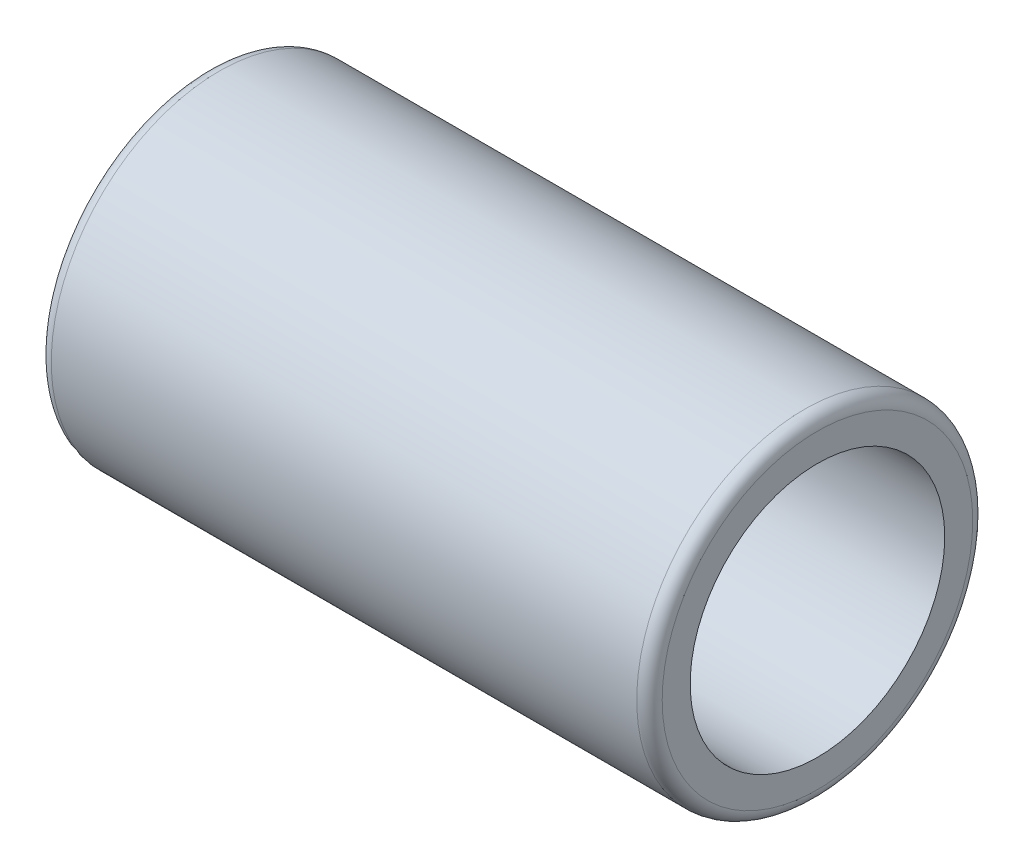
ISO-10303-21;
HEADER;
FILE_DESCRIPTION(('STEP AP214'),'2;1');
FILE_NAME('part.step','',(''),(''),'','','');
FILE_SCHEMA(('AUTOMOTIVE_DESIGN { 1 0 10303 214 1 1 1 1 }'));
ENDSEC;
DATA;
#1=APPLICATION_CONTEXT('core data for automotive mechanical design processes');
#2=APPLICATION_PROTOCOL_DEFINITION('international standard','automotive_design',2000,#1);
#3=PRODUCT_CONTEXT('',#1,'mechanical');
#4=PRODUCT('Part','Part','',(#3));
#5=PRODUCT_RELATED_PRODUCT_CATEGORY('part','',(#4));
#6=PRODUCT_DEFINITION_FORMATION('','',#4);
#7=PRODUCT_DEFINITION_CONTEXT('part definition',#1,'design');
#8=PRODUCT_DEFINITION('design','',#6,#7);
#9=PRODUCT_DEFINITION_SHAPE('','',#8);
#10=(LENGTH_UNIT() NAMED_UNIT(*) SI_UNIT(.MILLI.,.METRE.));
#11=(NAMED_UNIT(*) PLANE_ANGLE_UNIT() SI_UNIT($,.RADIAN.));
#12=(NAMED_UNIT(*) SI_UNIT($,.STERADIAN.) SOLID_ANGLE_UNIT());
#13=UNCERTAINTY_MEASURE_WITH_UNIT(LENGTH_MEASURE(1.E-05),#10,'distance_accuracy_value','');
#14=(GEOMETRIC_REPRESENTATION_CONTEXT(3) GLOBAL_UNCERTAINTY_ASSIGNED_CONTEXT((#13)) GLOBAL_UNIT_ASSIGNED_CONTEXT((#10,
#11,#12)) REPRESENTATION_CONTEXT('',''));
#15=CARTESIAN_POINT('',(0.,0.,0.));
#16=DIRECTION('',(0.,0.,1.));
#17=DIRECTION('',(1.,0.,0.));
#18=AXIS2_PLACEMENT_3D('',#15,#16,#17);
#19=CARTESIAN_POINT('',(-12.,0.,0.));
#20=DIRECTION('',(1.,0.,0.));
#21=DIRECTION('',(0.,0.,-1.));
#22=AXIS2_PLACEMENT_3D('',#19,#20,#21);
#23=CYLINDRICAL_SURFACE('',#22,6.6);
#24=CARTESIAN_POINT('',(11.5,0.,0.));
#25=DIRECTION('',(1.,0.,0.));
#26=DIRECTION('',(0.,0.,-1.));
#27=AXIS2_PLACEMENT_3D('',#24,#25,#26);
#28=CIRCLE('',#27,6.6);
#29=CARTESIAN_POINT('',(11.5,0.,-6.6));
#30=VERTEX_POINT('',#29);
#31=EDGE_CURVE('E42',#30,#30,#28,.F.);
#32=ORIENTED_EDGE('',*,*,#31,.T.);
#33=EDGE_LOOP('',(#32));
#34=FACE_BOUND('',#33,.T.);
#35=CARTESIAN_POINT('',(-11.5,0.,0.));
#36=DIRECTION('',(1.,0.,0.));
#37=DIRECTION('',(0.,0.,-1.));
#38=AXIS2_PLACEMENT_3D('',#35,#36,#37);
#39=CIRCLE('',#38,6.6);
#40=CARTESIAN_POINT('',(-11.5,0.,-6.6));
#41=VERTEX_POINT('',#40);
#42=EDGE_CURVE('E46',#41,#41,#39,.T.);
#43=ORIENTED_EDGE('',*,*,#42,.T.);
#44=EDGE_LOOP('',(#43));
#45=FACE_BOUND('',#44,.T.);
#46=ADVANCED_FACE('F35',(#34,#45),#23,.T.);
#47=CARTESIAN_POINT('',(-12.,0.,0.));
#48=DIRECTION('',(1.,0.,0.));
#49=DIRECTION('',(0.,0.,-1.));
#50=AXIS2_PLACEMENT_3D('',#47,#48,#49);
#51=PLANE('',#50);
#52=CARTESIAN_POINT('',(-12.,0.,0.));
#53=DIRECTION('',(1.,0.,0.));
#54=DIRECTION('',(0.,0.,-1.));
#55=AXIS2_PLACEMENT_3D('',#52,#53,#54);
#56=CIRCLE('',#55,6.1);
#57=CARTESIAN_POINT('',(-12.,0.,-6.1));
#58=VERTEX_POINT('',#57);
#59=EDGE_CURVE('E10',#58,#58,#56,.F.);
#60=ORIENTED_EDGE('',*,*,#59,.T.);
#61=EDGE_LOOP('',(#60));
#62=FACE_BOUND('',#61,.T.);
#63=CARTESIAN_POINT('',(-12.,0.,0.));
#64=DIRECTION('',(1.,0.,0.));
#65=DIRECTION('',(0.,0.,-1.));
#66=AXIS2_PLACEMENT_3D('',#63,#64,#65);
#67=CIRCLE('',#66,5.);
#68=CARTESIAN_POINT('',(-12.,0.,-5.));
#69=VERTEX_POINT('',#68);
#70=EDGE_CURVE('E55',#69,#69,#67,.T.);
#71=ORIENTED_EDGE('',*,*,#70,.T.);
#72=EDGE_LOOP('',(#71));
#73=FACE_BOUND('',#72,.T.);
#74=ADVANCED_FACE('F74',(#62,#73),#51,.F.);
#75=CARTESIAN_POINT('',(-12.,0.,0.));
#76=DIRECTION('',(1.,0.,0.));
#77=DIRECTION('',(0.,0.,-1.));
#78=AXIS2_PLACEMENT_3D('',#75,#76,#77);
#79=CYLINDRICAL_SURFACE('',#78,5.);
#80=ORIENTED_EDGE('',*,*,#70,.F.);
#81=EDGE_LOOP('',(#80));
#82=FACE_BOUND('',#81,.T.);
#83=CARTESIAN_POINT('',(12.,0.,0.));
#84=DIRECTION('',(1.,0.,0.));
#85=DIRECTION('',(0.,0.,-1.));
#86=AXIS2_PLACEMENT_3D('',#83,#84,#85);
#87=CIRCLE('',#86,5.);
#88=CARTESIAN_POINT('',(12.,0.,-5.));
#89=VERTEX_POINT('',#88);
#90=EDGE_CURVE('E58',#89,#89,#87,.T.);
#91=ORIENTED_EDGE('',*,*,#90,.T.);
#92=EDGE_LOOP('',(#91));
#93=FACE_BOUND('',#92,.T.);
#94=ADVANCED_FACE('F62',(#82,#93),#79,.F.);
#95=CARTESIAN_POINT('',(12.,0.,0.));
#96=DIRECTION('',(1.,0.,0.));
#97=DIRECTION('',(0.,0.,-1.));
#98=AXIS2_PLACEMENT_3D('',#95,#96,#97);
#99=PLANE('',#98);
#100=CARTESIAN_POINT('',(12.,0.,0.));
#101=DIRECTION('',(1.,0.,0.));
#102=DIRECTION('',(0.,0.,-1.));
#103=AXIS2_PLACEMENT_3D('',#100,#101,#102);
#104=CIRCLE('',#103,6.1);
#105=CARTESIAN_POINT('',(12.,0.,-6.1));
#106=VERTEX_POINT('',#105);
#107=EDGE_CURVE('E50',#106,#106,#104,.T.);
#108=ORIENTED_EDGE('',*,*,#107,.T.);
#109=EDGE_LOOP('',(#108));
#110=FACE_BOUND('',#109,.T.);
#111=ORIENTED_EDGE('',*,*,#90,.F.);
#112=EDGE_LOOP('',(#111));
#113=FACE_BOUND('',#112,.T.);
#114=ADVANCED_FACE('F64',(#110,#113),#99,.T.);
#115=CARTESIAN_POINT('',(11.5,0.,0.));
#116=DIRECTION('',(1.,0.,0.));
#117=DIRECTION('',(0.,0.,-1.));
#118=AXIS2_PLACEMENT_3D('',#115,#116,#117);
#119=TOROIDAL_SURFACE('',#118,6.1,0.5);
#120=ORIENTED_EDGE('',*,*,#31,.F.);
#121=EDGE_LOOP('',(#120));
#122=FACE_BOUND('',#121,.T.);
#123=ORIENTED_EDGE('',*,*,#107,.F.);
#124=EDGE_LOOP('',(#123));
#125=FACE_BOUND('',#124,.T.);
#126=ADVANCED_FACE('F66',(#122,#125),#119,.T.);
#127=CARTESIAN_POINT('',(-11.5,0.,0.));
#128=DIRECTION('',(1.,0.,0.));
#129=DIRECTION('',(0.,0.,-1.));
#130=AXIS2_PLACEMENT_3D('',#127,#128,#129);
#131=TOROIDAL_SURFACE('',#130,6.1,0.5);
#132=ORIENTED_EDGE('',*,*,#59,.F.);
#133=EDGE_LOOP('',(#132));
#134=FACE_BOUND('',#133,.T.);
#135=ORIENTED_EDGE('',*,*,#42,.F.);
#136=EDGE_LOOP('',(#135));
#137=FACE_BOUND('',#136,.T.);
#138=ADVANCED_FACE('F37',(#134,#137),#131,.T.);
#139=CLOSED_SHELL('',(#46,#74,#94,#114,#126,#138));
#140=MANIFOLD_SOLID_BREP('B2',#139);
#141=ADVANCED_BREP_SHAPE_REPRESENTATION('',(#18,#140),#14);
#142=SHAPE_DEFINITION_REPRESENTATION(#9,#141);
ENDSEC;
END-ISO-10303-21;
